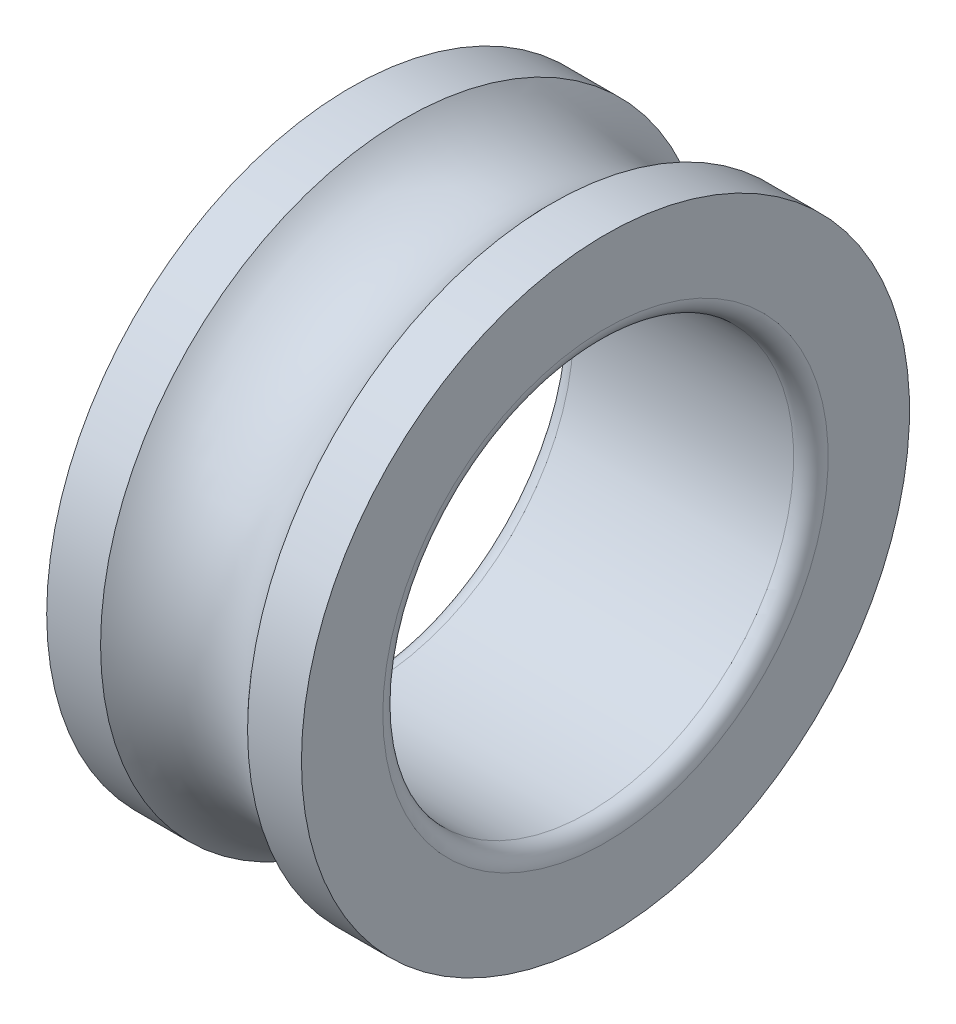
ISO-10303-21;
HEADER;
FILE_DESCRIPTION(('STEP AP214'),'2;1');
FILE_NAME('part.step','',(''),(''),'','','');
FILE_SCHEMA(('AUTOMOTIVE_DESIGN { 1 0 10303 214 1 1 1 1 }'));
ENDSEC;
DATA;
#1=APPLICATION_CONTEXT('core data for automotive mechanical design processes');
#2=APPLICATION_PROTOCOL_DEFINITION('international standard','automotive_design',2000,#1);
#3=PRODUCT_CONTEXT('',#1,'mechanical');
#4=PRODUCT('Part','Part','',(#3));
#5=PRODUCT_RELATED_PRODUCT_CATEGORY('part','',(#4));
#6=PRODUCT_DEFINITION_FORMATION('','',#4);
#7=PRODUCT_DEFINITION_CONTEXT('part definition',#1,'design');
#8=PRODUCT_DEFINITION('design','',#6,#7);
#9=PRODUCT_DEFINITION_SHAPE('','',#8);
#10=(LENGTH_UNIT() NAMED_UNIT(*) SI_UNIT(.MILLI.,.METRE.));
#11=(NAMED_UNIT(*) PLANE_ANGLE_UNIT() SI_UNIT($,.RADIAN.));
#12=(NAMED_UNIT(*) SI_UNIT($,.STERADIAN.) SOLID_ANGLE_UNIT());
#13=UNCERTAINTY_MEASURE_WITH_UNIT(LENGTH_MEASURE(1.E-05),#10,'distance_accuracy_value','');
#14=(GEOMETRIC_REPRESENTATION_CONTEXT(3) GLOBAL_UNCERTAINTY_ASSIGNED_CONTEXT((#13)) GLOBAL_UNIT_ASSIGNED_CONTEXT((#10,
#11,#12)) REPRESENTATION_CONTEXT('',''));
#15=CARTESIAN_POINT('',(0.,0.,0.));
#16=DIRECTION('',(0.,0.,1.));
#17=DIRECTION('',(1.,0.,0.));
#18=AXIS2_PLACEMENT_3D('',#15,#16,#17);
#19=CARTESIAN_POINT('',(-15.5,37.,0.));
#20=DIRECTION('',(1.,0.,0.));
#21=DIRECTION('',(0.,0.,-1.));
#22=AXIS2_PLACEMENT_3D('',#19,#20,#21);
#23=PLANE('',#22);
#24=CARTESIAN_POINT('',(-15.5,0.,0.));
#25=DIRECTION('',(-1.,0.,0.));
#26=DIRECTION('',(0.,0.,1.));
#27=AXIS2_PLACEMENT_3D('',#24,#25,#26);
#28=CIRCLE('',#27,27.1);
#29=CARTESIAN_POINT('',(-15.5,0.,27.1));
#30=VERTEX_POINT('',#29);
#31=EDGE_CURVE('E10',#30,#30,#28,.T.);
#32=ORIENTED_EDGE('',*,*,#31,.F.);
#33=EDGE_LOOP('',(#32));
#34=FACE_BOUND('',#33,.T.);
#35=CARTESIAN_POINT('',(-15.5,0.,0.));
#36=DIRECTION('',(-1.,0.,0.));
#37=DIRECTION('',(0.,0.,1.));
#38=AXIS2_PLACEMENT_3D('',#35,#36,#37);
#39=CIRCLE('',#38,37.);
#40=CARTESIAN_POINT('',(-15.5,0.,37.));
#41=VERTEX_POINT('',#40);
#42=EDGE_CURVE('E78',#41,#41,#39,.T.);
#43=ORIENTED_EDGE('',*,*,#42,.T.);
#44=EDGE_LOOP('',(#43));
#45=FACE_BOUND('',#44,.T.);
#46=ADVANCED_FACE('F43',(#34,#45),#23,.F.);
#47=CARTESIAN_POINT('',(-13.4,0.,0.));
#48=DIRECTION('',(-1.,0.,0.));
#49=DIRECTION('',(0.,0.,1.));
#50=AXIS2_PLACEMENT_3D('',#47,#48,#49);
#51=TOROIDAL_SURFACE('',#50,27.1,2.1);
#52=CARTESIAN_POINT('',(-13.4,0.,0.));
#53=DIRECTION('',(-1.,0.,0.));
#54=DIRECTION('',(0.,0.,1.));
#55=AXIS2_PLACEMENT_3D('',#52,#53,#54);
#56=CIRCLE('',#55,25.);
#57=CARTESIAN_POINT('',(-13.4,0.,25.));
#58=VERTEX_POINT('',#57);
#59=EDGE_CURVE('E50',#58,#58,#56,.T.);
#60=ORIENTED_EDGE('',*,*,#59,.F.);
#61=EDGE_LOOP('',(#60));
#62=FACE_BOUND('',#61,.T.);
#63=ORIENTED_EDGE('',*,*,#31,.T.);
#64=EDGE_LOOP('',(#63));
#65=FACE_BOUND('',#64,.T.);
#66=ADVANCED_FACE('F116',(#62,#65),#51,.T.);
#67=CARTESIAN_POINT('',(-27.1367521367521,0.,0.));
#68=DIRECTION('',(-1.,0.,0.));
#69=DIRECTION('',(0.,0.,1.));
#70=AXIS2_PLACEMENT_3D('',#67,#68,#69);
#71=CYLINDRICAL_SURFACE('',#70,25.);
#72=CARTESIAN_POINT('',(13.4,0.,0.));
#73=DIRECTION('',(-1.,0.,0.));
#74=DIRECTION('',(0.,0.,1.));
#75=AXIS2_PLACEMENT_3D('',#72,#73,#74);
#76=CIRCLE('',#75,25.);
#77=CARTESIAN_POINT('',(13.4,0.,25.));
#78=VERTEX_POINT('',#77);
#79=EDGE_CURVE('E55',#78,#78,#76,.T.);
#80=ORIENTED_EDGE('',*,*,#79,.F.);
#81=EDGE_LOOP('',(#80));
#82=FACE_BOUND('',#81,.T.);
#83=ORIENTED_EDGE('',*,*,#59,.T.);
#84=EDGE_LOOP('',(#83));
#85=FACE_BOUND('',#84,.T.);
#86=ADVANCED_FACE('F111',(#82,#85),#71,.F.);
#87=CARTESIAN_POINT('',(13.4,0.,0.));
#88=DIRECTION('',(-1.,0.,0.));
#89=DIRECTION('',(0.,0.,1.));
#90=AXIS2_PLACEMENT_3D('',#87,#88,#89);
#91=TOROIDAL_SURFACE('',#90,27.1,2.1);
#92=CARTESIAN_POINT('',(15.5,0.,0.));
#93=DIRECTION('',(-1.,0.,0.));
#94=DIRECTION('',(0.,0.,1.));
#95=AXIS2_PLACEMENT_3D('',#92,#93,#94);
#96=CIRCLE('',#95,27.1);
#97=CARTESIAN_POINT('',(15.5,0.,27.1));
#98=VERTEX_POINT('',#97);
#99=EDGE_CURVE('E60',#98,#98,#96,.T.);
#100=ORIENTED_EDGE('',*,*,#99,.F.);
#101=EDGE_LOOP('',(#100));
#102=FACE_BOUND('',#101,.T.);
#103=ORIENTED_EDGE('',*,*,#79,.T.);
#104=EDGE_LOOP('',(#103));
#105=FACE_BOUND('',#104,.T.);
#106=ADVANCED_FACE('F105',(#102,#105),#91,.T.);
#107=CARTESIAN_POINT('',(15.5,37.,0.));
#108=DIRECTION('',(-1.,0.,0.));
#109=DIRECTION('',(0.,0.,1.));
#110=AXIS2_PLACEMENT_3D('',#107,#108,#109);
#111=PLANE('',#110);
#112=CARTESIAN_POINT('',(15.5,0.,0.));
#113=DIRECTION('',(-1.,0.,0.));
#114=DIRECTION('',(0.,0.,1.));
#115=AXIS2_PLACEMENT_3D('',#112,#113,#114);
#116=CIRCLE('',#115,37.);
#117=CARTESIAN_POINT('',(15.5,0.,37.));
#118=VERTEX_POINT('',#117);
#119=EDGE_CURVE('E66',#118,#118,#116,.T.);
#120=ORIENTED_EDGE('',*,*,#119,.F.);
#121=EDGE_LOOP('',(#120));
#122=FACE_BOUND('',#121,.T.);
#123=ORIENTED_EDGE('',*,*,#99,.T.);
#124=EDGE_LOOP('',(#123));
#125=FACE_BOUND('',#124,.T.);
#126=ADVANCED_FACE('F99',(#122,#125),#111,.F.);
#127=CARTESIAN_POINT('',(-27.1367521367521,0.,0.));
#128=DIRECTION('',(-1.,0.,0.));
#129=DIRECTION('',(0.,0.,1.));
#130=AXIS2_PLACEMENT_3D('',#127,#128,#129);
#131=CYLINDRICAL_SURFACE('',#130,37.);
#132=CARTESIAN_POINT('',(8.94427190999917,0.,0.));
#133=DIRECTION('',(-1.,0.,0.));
#134=DIRECTION('',(0.,0.,1.));
#135=AXIS2_PLACEMENT_3D('',#132,#133,#134);
#136=CIRCLE('',#135,37.);
#137=CARTESIAN_POINT('',(8.94427190999917,0.,37.));
#138=VERTEX_POINT('',#137);
#139=EDGE_CURVE('E70',#138,#138,#136,.T.);
#140=ORIENTED_EDGE('',*,*,#139,.F.);
#141=EDGE_LOOP('',(#140));
#142=FACE_BOUND('',#141,.T.);
#143=ORIENTED_EDGE('',*,*,#119,.T.);
#144=EDGE_LOOP('',(#143));
#145=FACE_BOUND('',#144,.T.);
#146=ADVANCED_FACE('F93',(#142,#145),#131,.T.);
#147=CARTESIAN_POINT('',(0.,0.,0.));
#148=DIRECTION('',(-1.,0.,0.));
#149=DIRECTION('',(0.,0.,1.));
#150=AXIS2_PLACEMENT_3D('',#147,#148,#149);
#151=TOROIDAL_SURFACE('',#150,45.,12.);
#152=CARTESIAN_POINT('',(-8.94427190999916,0.,0.));
#153=DIRECTION('',(-1.,0.,0.));
#154=DIRECTION('',(0.,0.,1.));
#155=AXIS2_PLACEMENT_3D('',#152,#153,#154);
#156=CIRCLE('',#155,37.);
#157=CARTESIAN_POINT('',(-8.94427190999916,0.,37.));
#158=VERTEX_POINT('',#157);
#159=EDGE_CURVE('E74',#158,#158,#156,.T.);
#160=ORIENTED_EDGE('',*,*,#159,.F.);
#161=EDGE_LOOP('',(#160));
#162=FACE_BOUND('',#161,.T.);
#163=ORIENTED_EDGE('',*,*,#139,.T.);
#164=EDGE_LOOP('',(#163));
#165=FACE_BOUND('',#164,.T.);
#166=ADVANCED_FACE('F87',(#162,#165),#151,.F.);
#167=CARTESIAN_POINT('',(-27.1367521367521,0.,0.));
#168=DIRECTION('',(-1.,0.,0.));
#169=DIRECTION('',(0.,0.,1.));
#170=AXIS2_PLACEMENT_3D('',#167,#168,#169);
#171=CYLINDRICAL_SURFACE('',#170,37.);
#172=ORIENTED_EDGE('',*,*,#42,.F.);
#173=EDGE_LOOP('',(#172));
#174=FACE_BOUND('',#173,.T.);
#175=ORIENTED_EDGE('',*,*,#159,.T.);
#176=EDGE_LOOP('',(#175));
#177=FACE_BOUND('',#176,.T.);
#178=ADVANCED_FACE('F84',(#174,#177),#171,.T.);
#179=CLOSED_SHELL('',(#46,#66,#86,#106,#126,#146,#166,#178));
#180=MANIFOLD_SOLID_BREP('B2',#179);
#181=ADVANCED_BREP_SHAPE_REPRESENTATION('',(#18,#180),#14);
#182=SHAPE_DEFINITION_REPRESENTATION(#9,#181);
ENDSEC;
END-ISO-10303-21;
